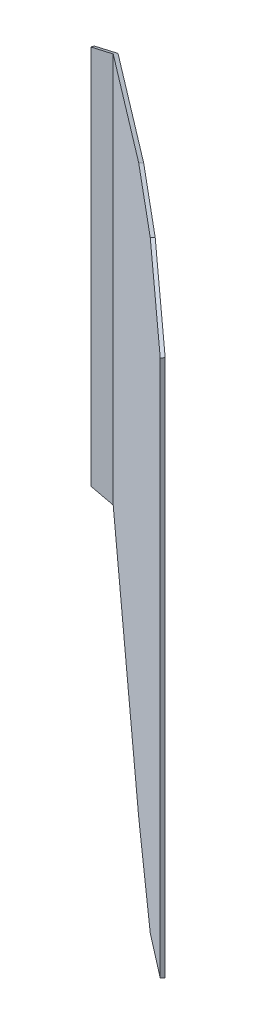
ISO-10303-21;
HEADER;
FILE_DESCRIPTION(('STEP AP214'),'2;1');
FILE_NAME('part.step','',(''),(''),'','','');
FILE_SCHEMA(('AUTOMOTIVE_DESIGN { 1 0 10303 214 1 1 1 1 }'));
ENDSEC;
DATA;
#1=APPLICATION_CONTEXT('core data for automotive mechanical design processes');
#2=APPLICATION_PROTOCOL_DEFINITION('international standard','automotive_design',2000,#1);
#3=PRODUCT_CONTEXT('',#1,'mechanical');
#4=PRODUCT('Part','Part','',(#3));
#5=PRODUCT_RELATED_PRODUCT_CATEGORY('part','',(#4));
#6=PRODUCT_DEFINITION_FORMATION('','',#4);
#7=PRODUCT_DEFINITION_CONTEXT('part definition',#1,'design');
#8=PRODUCT_DEFINITION('design','',#6,#7);
#9=PRODUCT_DEFINITION_SHAPE('','',#8);
#10=(LENGTH_UNIT() NAMED_UNIT(*) SI_UNIT(.MILLI.,.METRE.));
#11=(NAMED_UNIT(*) PLANE_ANGLE_UNIT() SI_UNIT($,.RADIAN.));
#12=(NAMED_UNIT(*) SI_UNIT($,.STERADIAN.) SOLID_ANGLE_UNIT());
#13=UNCERTAINTY_MEASURE_WITH_UNIT(LENGTH_MEASURE(1.E-05),#10,'distance_accuracy_value','');
#14=(GEOMETRIC_REPRESENTATION_CONTEXT(3) GLOBAL_UNCERTAINTY_ASSIGNED_CONTEXT((#13)) GLOBAL_UNIT_ASSIGNED_CONTEXT((#10,
#11,#12)) REPRESENTATION_CONTEXT('',''));
#15=CARTESIAN_POINT('',(0.,0.,0.));
#16=DIRECTION('',(0.,0.,1.));
#17=DIRECTION('',(1.,0.,0.));
#18=AXIS2_PLACEMENT_3D('',#15,#16,#17);
#19=CARTESIAN_POINT('',(958.263871938385,-400.,462.03543703626));
#20=DIRECTION('',(0.656059028990508,0.,-0.754709580222771));
#21=DIRECTION('',(-0.754709580222771,0.,-0.656059028990508));
#22=AXIS2_PLACEMENT_3D('',#19,#20,#21);
#23=PLANE('',#22);
#24=DIRECTION('',(-0.714377011708552,-0.322531231414625,-0.620998462079033));
#25=VECTOR('',#24,1.);
#26=CARTESIAN_POINT('',(771.730349835547,325.358760794224,299.884320114112));
#27=LINE('',#26,#25);
#28=CARTESIAN_POINT('',(769.864547225332,324.516377005852,298.262402649669));
#29=VERTEX_POINT('',#28);
#30=CARTESIAN_POINT('',(545.,222.993178289504,102.790633941637));
#31=VERTEX_POINT('',#30);
#32=EDGE_CURVE('E133',#29,#31,#27,.T.);
#33=ORIENTED_EDGE('',*,*,#32,.F.);
#34=DIRECTION('',(0.74602943431762,0.151229402481054,0.648513493272851));
#35=VECTOR('',#34,1.);
#36=CARTESIAN_POINT('',(872.214030364498,345.263884365985,387.233450964892));
#37=LINE('',#36,#35);
#38=CARTESIAN_POINT('',(870.728695458336,344.962788591462,385.942269029749));
#39=VERTEX_POINT('',#38);
#40=EDGE_CURVE('E124',#29,#39,#37,.T.);
#41=ORIENTED_EDGE('',*,*,#40,.T.);
#42=DIRECTION('',(0.718149384400474,-0.307471576705268,0.624277735630221));
#43=VECTOR('',#42,1.);
#44=CARTESIAN_POINT('',(1114.48402734046,240.60032884128,597.835546306873));
#45=LINE('',#44,#43);
#46=CARTESIAN_POINT('',(958.263871938385,307.485100363735,462.03543703626));
#47=VERTEX_POINT('',#46);
#48=EDGE_CURVE('E130',#39,#47,#45,.T.);
#49=ORIENTED_EDGE('',*,*,#48,.T.);
#50=DIRECTION('',(0.,1.,0.));
#51=VECTOR('',#50,1.);
#52=CARTESIAN_POINT('',(958.263871938385,-400.,462.03543703626));
#53=LINE('',#52,#51);
#54=CARTESIAN_POINT('',(958.263871938385,-307.485100363735,462.03543703626));
#55=VERTEX_POINT('',#54);
#56=EDGE_CURVE('E185',#55,#47,#53,.T.);
#57=ORIENTED_EDGE('',*,*,#56,.F.);
#58=DIRECTION('',(-0.718149384400474,-0.307471576705268,-0.624277735630221));
#59=VECTOR('',#58,1.);
#60=CARTESIAN_POINT('',(937.835608515234,-316.231345226578,444.277418565898));
#61=LINE('',#60,#59);
#62=CARTESIAN_POINT('',(870.728695458336,-344.962788591462,385.942269029749));
#63=VERTEX_POINT('',#62);
#64=EDGE_CURVE('E154',#55,#63,#61,.T.);
#65=ORIENTED_EDGE('',*,*,#64,.T.);
#66=DIRECTION('',(-0.74602943431762,0.151229402481054,-0.648513493272851));
#67=VECTOR('',#66,1.);
#68=CARTESIAN_POINT('',(962.471298832604,-363.560150105806,465.692897435735));
#69=LINE('',#68,#67);
#70=CARTESIAN_POINT('',(769.864547225336,-324.516377005853,298.262402649672));
#71=VERTEX_POINT('',#70);
#72=EDGE_CURVE('E145',#63,#71,#69,.T.);
#73=ORIENTED_EDGE('',*,*,#72,.T.);
#74=DIRECTION('',(-0.714377011708552,0.322531231414625,-0.620998462079033));
#75=VECTOR('',#74,1.);
#76=CARTESIAN_POINT('',(956.057467660075,-408.579876984491,460.117439058863));
#77=LINE('',#76,#75);
#78=CARTESIAN_POINT('',(545.,-222.993178289503,102.790633941637));
#79=VERTEX_POINT('',#78);
#80=EDGE_CURVE('E161',#71,#79,#77,.T.);
#81=ORIENTED_EDGE('',*,*,#80,.T.);
#82=DIRECTION('',(0.,1.,0.));
#83=VECTOR('',#82,1.);
#84=CARTESIAN_POINT('',(545.,-400.,102.790633941637));
#85=LINE('',#84,#83);
#86=EDGE_CURVE('E183',#79,#31,#85,.T.);
#87=ORIENTED_EDGE('',*,*,#86,.T.);
#88=EDGE_LOOP('',(#33,#41,#49,#57,#65,#73,#81,#87));
#89=FACE_BOUND('',#88,.T.);
#90=ADVANCED_FACE('F48',(#89),#23,.T.);
#91=CARTESIAN_POINT('',(955.639635822423,-400.,465.054275357151));
#92=DIRECTION('',(0.656059028990508,0.,-0.754709580222771));
#93=DIRECTION('',(-0.754709580222771,0.,-0.656059028990508));
#94=AXIS2_PLACEMENT_3D('',#91,#92,#93);
#95=PLANE('',#94);
#96=DIRECTION('',(0.74602943431762,0.151229402481054,0.648513493272851));
#97=VECTOR('',#96,1.);
#98=CARTESIAN_POINT('',(869.589794248536,345.263884365985,390.252289285783));
#99=LINE('',#98,#97);
#100=CARTESIAN_POINT('',(766.567607797982,324.380011716296,300.696468903486));
#101=VERTEX_POINT('',#100);
#102=CARTESIAN_POINT('',(868.104459342374,344.962788591462,388.96110735064));
#103=VERTEX_POINT('',#102);
#104=EDGE_CURVE('E63',#101,#103,#99,.T.);
#105=ORIENTED_EDGE('',*,*,#104,.F.);
#106=DIRECTION('',(-0.714377011708552,-0.322531231414625,-0.620998462079033));
#107=VECTOR('',#106,1.);
#108=CARTESIAN_POINT('',(769.067554595031,325.508702737574,302.869639499406));
#109=LINE('',#108,#107);
#110=CARTESIAN_POINT('',(543.504461282061,223.67012023066,106.790633941637));
#111=VERTEX_POINT('',#110);
#112=EDGE_CURVE('E170',#101,#111,#109,.T.);
#113=ORIENTED_EDGE('',*,*,#112,.T.);
#114=DIRECTION('',(0.,1.,0.));
#115=VECTOR('',#114,1.);
#116=CARTESIAN_POINT('',(543.504461282061,-400.,106.790633941637));
#117=LINE('',#116,#115);
#118=CARTESIAN_POINT('',(543.504461282061,-223.670120230659,106.790633941637));
#119=VERTEX_POINT('',#118);
#120=EDGE_CURVE('E190',#119,#111,#117,.T.);
#121=ORIENTED_EDGE('',*,*,#120,.F.);
#122=DIRECTION('',(-0.714377011708552,0.322531231414625,-0.620998462079033));
#123=VECTOR('',#122,1.);
#124=CARTESIAN_POINT('',(953.394672419559,-408.729818927841,463.102758444158));
#125=LINE('',#124,#123);
#126=CARTESIAN_POINT('',(766.567607797986,-324.380011716297,300.696468903489));
#127=VERTEX_POINT('',#126);
#128=EDGE_CURVE('E159',#127,#119,#125,.T.);
#129=ORIENTED_EDGE('',*,*,#128,.F.);
#130=DIRECTION('',(-0.74602943431762,0.151229402481054,-0.648513493272851));
#131=VECTOR('',#130,1.);
#132=CARTESIAN_POINT('',(959.847062716642,-363.560150105806,468.711735756626));
#133=LINE('',#132,#131);
#134=CARTESIAN_POINT('',(868.104459342374,-344.962788591462,388.96110735064));
#135=VERTEX_POINT('',#134);
#136=EDGE_CURVE('E139',#135,#127,#133,.T.);
#137=ORIENTED_EDGE('',*,*,#136,.F.);
#138=DIRECTION('',(-0.718149384400474,-0.307471576705268,-0.624277735630221));
#139=VECTOR('',#138,1.);
#140=CARTESIAN_POINT('',(935.211372399272,-316.231345226578,447.296256886789));
#141=LINE('',#140,#139);
#142=CARTESIAN_POINT('',(955.639635822423,-307.485100363735,465.054275357151));
#143=VERTEX_POINT('',#142);
#144=EDGE_CURVE('E151',#143,#135,#141,.T.);
#145=ORIENTED_EDGE('',*,*,#144,.F.);
#146=DIRECTION('',(0.,1.,0.));
#147=VECTOR('',#146,1.);
#148=CARTESIAN_POINT('',(955.639635822423,-400.,465.054275357151));
#149=LINE('',#148,#147);
#150=CARTESIAN_POINT('',(955.639635822423,307.485100363735,465.054275357151));
#151=VERTEX_POINT('',#150);
#152=EDGE_CURVE('E187',#143,#151,#149,.T.);
#153=ORIENTED_EDGE('',*,*,#152,.T.);
#154=DIRECTION('',(0.718149384400474,-0.307471576705268,0.624277735630221));
#155=VECTOR('',#154,1.);
#156=CARTESIAN_POINT('',(1111.8597912245,240.60032884128,600.854384627764));
#157=LINE('',#156,#155);
#158=EDGE_CURVE('E69',#103,#151,#157,.T.);
#159=ORIENTED_EDGE('',*,*,#158,.F.);
#160=EDGE_LOOP('',(#105,#113,#121,#129,#137,#145,#153,#159));
#161=FACE_BOUND('',#160,.T.);
#162=ADVANCED_FACE('F207',(#161),#95,.F.);
#163=CARTESIAN_POINT('',(-14.7084032822513,64.0296572140644,-16.3353367584323));
#164=DIRECTION('',(0.217265952213146,-0.945817447178789,0.241298285574338));
#165=DIRECTION('',(0.,-0.247203369569301,-0.968963618550038));
#166=AXIS2_PLACEMENT_3D('',#163,#164,#165);
#167=PLANE('',#166);
#168=DIRECTION('',(-0.804057823289808,-0.0332567765677724,0.593620252028834));
#169=VECTOR('',#168,1.);
#170=CARTESIAN_POINT('',(405.824651558385,309.459259070707,567.025977053042));
#171=LINE('',#170,#169);
#172=EDGE_CURVE('E134',#29,#101,#171,.T.);
#173=ORIENTED_EDGE('',*,*,#172,.F.);
#174=ORIENTED_EDGE('',*,*,#32,.T.);
#175=DIRECTION('',(-0.974616389908166,-0.223881425139231,0.));
#176=VECTOR('',#175,1.);
#177=CARTESIAN_POINT('',(409.063819039281,191.766958171927,102.790633941637));
#178=LINE('',#177,#176);
#179=CARTESIAN_POINT('',(517.881642577774,216.763756570364,102.790633941637));
#180=VERTEX_POINT('',#179);
#181=EDGE_CURVE('E173',#31,#180,#178,.T.);
#182=ORIENTED_EDGE('',*,*,#181,.T.);
#183=DIRECTION('',(0.,-0.247203369569301,-0.968963618550038));
#184=VECTOR('',#183,1.);
#185=CARTESIAN_POINT('',(517.881642577774,180.031752419011,-41.1878875530394));
#186=LINE('',#185,#184);
#187=CARTESIAN_POINT('',(517.881642577774,217.784242230865,106.790633941637));
#188=VERTEX_POINT('',#187);
#189=EDGE_CURVE('E176',#188,#180,#186,.T.);
#190=ORIENTED_EDGE('',*,*,#189,.F.);
#191=DIRECTION('',(-0.974616389908166,-0.223881425139231,0.));
#192=VECTOR('',#191,1.);
#193=CARTESIAN_POINT('',(408.841150592422,192.736294139346,106.790633941637));
#194=LINE('',#193,#192);
#195=EDGE_CURVE('E179',#111,#188,#194,.T.);
#196=ORIENTED_EDGE('',*,*,#195,.F.);
#197=ORIENTED_EDGE('',*,*,#112,.F.);
#198=EDGE_LOOP('',(#173,#174,#182,#190,#196,#197));
#199=FACE_BOUND('',#198,.T.);
#200=ADVANCED_FACE('F221',(#199),#167,.F.);
#201=CARTESIAN_POINT('',(141.124135037064,578.697205104585,122.677338973506));
#202=DIRECTION('',(0.232051744585666,0.95155726549608,0.201719504055439));
#203=DIRECTION('',(0.97152865701298,-0.236922072847922,0.));
#204=AXIS2_PLACEMENT_3D('',#201,#202,#203);
#205=PLANE('',#204);
#206=ORIENTED_EDGE('',*,*,#48,.F.);
#207=DIRECTION('',(-0.656059028990508,0.,0.754709580222771));
#208=VECTOR('',#207,1.);
#209=CARTESIAN_POINT('',(687.048506749006,344.962788591462,597.242155153355));
#210=LINE('',#209,#208);
#211=EDGE_CURVE('E13',#39,#103,#210,.T.);
#212=ORIENTED_EDGE('',*,*,#211,.T.);
#213=ORIENTED_EDGE('',*,*,#158,.T.);
#214=DIRECTION('',(0.656059028990517,0.,-0.754709580222763));
#215=VECTOR('',#214,1.);
#216=CARTESIAN_POINT('',(958.263871938387,307.485100363735,462.035437036257));
#217=LINE('',#216,#215);
#218=EDGE_CURVE('E137',#151,#47,#217,.T.);
#219=ORIENTED_EDGE('',*,*,#218,.T.);
#220=EDGE_LOOP('',(#206,#212,#213,#219));
#221=FACE_BOUND('',#220,.T.);
#222=ADVANCED_FACE('F136',(#221),#205,.T.);
#223=CARTESIAN_POINT('',(958.263871938385,-400.,462.03543703626));
#224=DIRECTION('',(-0.754709580222763,0.,-0.656059028990517));
#225=DIRECTION('',(-0.656059028990517,0.,0.754709580222763));
#226=AXIS2_PLACEMENT_3D('',#223,#224,#225);
#227=PLANE('',#226);
#228=ORIENTED_EDGE('',*,*,#218,.F.);
#229=ORIENTED_EDGE('',*,*,#152,.F.);
#230=DIRECTION('',(-0.656059028990517,0.,0.754709580222763));
#231=VECTOR('',#230,1.);
#232=CARTESIAN_POINT('',(958.263871938385,-307.485100363735,462.03543703626));
#233=LINE('',#232,#231);
#234=EDGE_CURVE('E157',#55,#143,#233,.T.);
#235=ORIENTED_EDGE('',*,*,#234,.F.);
#236=ORIENTED_EDGE('',*,*,#56,.T.);
#237=EDGE_LOOP('',(#228,#229,#235,#236));
#238=FACE_BOUND('',#237,.T.);
#239=ADVANCED_FACE('F204',(#238),#227,.F.);
#240=CARTESIAN_POINT('',(-14.7084032822511,-64.0296572140637,-16.3353367584321));
#241=DIRECTION('',(-0.217265952213146,-0.945817447178788,-0.241298285574338));
#242=DIRECTION('',(0.,0.247203369569301,-0.968963618550038));
#243=AXIS2_PLACEMENT_3D('',#240,#241,#242);
#244=PLANE('',#243);
#245=ORIENTED_EDGE('',*,*,#80,.F.);
#246=DIRECTION('',(-0.804057823289808,0.0332567765677724,0.593620252028835));
#247=VECTOR('',#246,1.);
#248=CARTESIAN_POINT('',(405.824651558387,-309.459259070708,567.025977053045));
#249=LINE('',#248,#247);
#250=EDGE_CURVE('E148',#71,#127,#249,.T.);
#251=ORIENTED_EDGE('',*,*,#250,.T.);
#252=ORIENTED_EDGE('',*,*,#128,.T.);
#253=DIRECTION('',(-0.974616389908166,0.223881425139231,0.));
#254=VECTOR('',#253,1.);
#255=CARTESIAN_POINT('',(583.399955661777,-232.834608157244,106.790633941637));
#256=LINE('',#255,#254);
#257=CARTESIAN_POINT('',(517.881642577774,-217.784242230864,106.790633941637));
#258=VERTEX_POINT('',#257);
#259=EDGE_CURVE('E168',#119,#258,#256,.T.);
#260=ORIENTED_EDGE('',*,*,#259,.T.);
#261=DIRECTION('',(0.,0.247203369569301,-0.968963618550038));
#262=VECTOR('',#261,1.);
#263=CARTESIAN_POINT('',(517.881642577774,-228.919357160144,150.436969643466));
#264=LINE('',#263,#262);
#265=CARTESIAN_POINT('',(517.881642577774,-216.763756570363,102.790633941637));
#266=VERTEX_POINT('',#265);
#267=EDGE_CURVE('E166',#258,#266,#264,.T.);
#268=ORIENTED_EDGE('',*,*,#267,.T.);
#269=DIRECTION('',(-0.974616389908166,0.223881425139231,0.));
#270=VECTOR('',#269,1.);
#271=CARTESIAN_POINT('',(583.622624108636,-231.865272189825,102.790633941637));
#272=LINE('',#271,#270);
#273=EDGE_CURVE('E163',#79,#266,#272,.T.);
#274=ORIENTED_EDGE('',*,*,#273,.F.);
#275=EDGE_LOOP('',(#245,#251,#252,#260,#268,#274));
#276=FACE_BOUND('',#275,.T.);
#277=ADVANCED_FACE('F212',(#276),#244,.T.);
#278=CARTESIAN_POINT('',(141.124135037064,-578.697205104585,122.677338973506));
#279=DIRECTION('',(0.232051744585666,-0.95155726549608,0.201719504055439));
#280=DIRECTION('',(0.97152865701298,0.236922072847922,0.));
#281=AXIS2_PLACEMENT_3D('',#278,#279,#280);
#282=PLANE('',#281);
#283=ORIENTED_EDGE('',*,*,#144,.T.);
#284=DIRECTION('',(0.656059028990508,0.,-0.754709580222771));
#285=VECTOR('',#284,1.);
#286=CARTESIAN_POINT('',(687.048506749006,-344.962788591462,597.242155153355));
#287=LINE('',#286,#285);
#288=EDGE_CURVE('E56',#135,#63,#287,.T.);
#289=ORIENTED_EDGE('',*,*,#288,.T.);
#290=ORIENTED_EDGE('',*,*,#64,.F.);
#291=ORIENTED_EDGE('',*,*,#234,.T.);
#292=EDGE_LOOP('',(#283,#289,#290,#291));
#293=FACE_BOUND('',#292,.T.);
#294=ADVANCED_FACE('F197',(#293),#282,.T.);
#295=CARTESIAN_POINT('',(545.,-400.,102.790633941637));
#296=DIRECTION('',(0.,0.,-1.));
#297=DIRECTION('',(-1.,0.,0.));
#298=AXIS2_PLACEMENT_3D('',#295,#296,#297);
#299=PLANE('',#298);
#300=ORIENTED_EDGE('',*,*,#86,.F.);
#301=ORIENTED_EDGE('',*,*,#273,.T.);
#302=DIRECTION('',(0.,1.,0.));
#303=VECTOR('',#302,1.);
#304=CARTESIAN_POINT('',(517.881642577774,-400.,102.790633941637));
#305=LINE('',#304,#303);
#306=EDGE_CURVE('E182',#266,#180,#305,.T.);
#307=ORIENTED_EDGE('',*,*,#306,.T.);
#308=ORIENTED_EDGE('',*,*,#181,.F.);
#309=EDGE_LOOP('',(#300,#301,#307,#308));
#310=FACE_BOUND('',#309,.T.);
#311=ADVANCED_FACE('F50',(#310),#299,.T.);
#312=CARTESIAN_POINT('',(545.,-400.,106.790633941637));
#313=DIRECTION('',(0.,0.,-1.));
#314=DIRECTION('',(-1.,0.,0.));
#315=AXIS2_PLACEMENT_3D('',#312,#313,#314);
#316=PLANE('',#315);
#317=ORIENTED_EDGE('',*,*,#259,.F.);
#318=ORIENTED_EDGE('',*,*,#120,.T.);
#319=ORIENTED_EDGE('',*,*,#195,.T.);
#320=DIRECTION('',(0.,1.,0.));
#321=VECTOR('',#320,1.);
#322=CARTESIAN_POINT('',(517.881642577774,-400.,106.790633941637));
#323=LINE('',#322,#321);
#324=EDGE_CURVE('E193',#258,#188,#323,.T.);
#325=ORIENTED_EDGE('',*,*,#324,.F.);
#326=EDGE_LOOP('',(#317,#318,#319,#325));
#327=FACE_BOUND('',#326,.T.);
#328=ADVANCED_FACE('F228',(#327),#316,.F.);
#329=CARTESIAN_POINT('',(517.881642577774,-400.,106.790633941637));
#330=DIRECTION('',(1.,0.,0.));
#331=DIRECTION('',(0.,0.,-1.));
#332=AXIS2_PLACEMENT_3D('',#329,#330,#331);
#333=PLANE('',#332);
#334=ORIENTED_EDGE('',*,*,#267,.F.);
#335=ORIENTED_EDGE('',*,*,#324,.T.);
#336=ORIENTED_EDGE('',*,*,#189,.T.);
#337=ORIENTED_EDGE('',*,*,#306,.F.);
#338=EDGE_LOOP('',(#334,#335,#336,#337));
#339=FACE_BOUND('',#338,.T.);
#340=ADVANCED_FACE('F225',(#339),#333,.F.);
#341=CARTESIAN_POINT('',(-23.2062212072235,-200.985361995135,-20.1728603302691));
#342=DIRECTION('',(-0.114134278863817,-0.988498693891511,-0.0992154149465349));
#343=DIRECTION('',(0.9934001516634,-0.114700212184349,0.));
#344=AXIS2_PLACEMENT_3D('',#341,#342,#343);
#345=PLANE('',#344);
#346=ORIENTED_EDGE('',*,*,#250,.F.);
#347=ORIENTED_EDGE('',*,*,#72,.F.);
#348=ORIENTED_EDGE('',*,*,#288,.F.);
#349=ORIENTED_EDGE('',*,*,#136,.T.);
#350=EDGE_LOOP('',(#346,#347,#348,#349));
#351=FACE_BOUND('',#350,.T.);
#352=ADVANCED_FACE('F210',(#351),#345,.T.);
#353=CARTESIAN_POINT('',(-23.2062212072235,200.985361995135,-20.1728603302691));
#354=DIRECTION('',(-0.114134278863817,0.988498693891511,-0.0992154149465349));
#355=DIRECTION('',(0.9934001516634,0.114700212184349,0.));
#356=AXIS2_PLACEMENT_3D('',#353,#354,#355);
#357=PLANE('',#356);
#358=ORIENTED_EDGE('',*,*,#40,.F.);
#359=ORIENTED_EDGE('',*,*,#172,.T.);
#360=ORIENTED_EDGE('',*,*,#104,.T.);
#361=ORIENTED_EDGE('',*,*,#211,.F.);
#362=EDGE_LOOP('',(#358,#359,#360,#361));
#363=FACE_BOUND('',#362,.T.);
#364=ADVANCED_FACE('F123',(#363),#357,.T.);
#365=CLOSED_SHELL('',(#90,#162,#200,#222,#239,#277,#294,#311,#328,#340,#352,#364));
#366=MANIFOLD_SOLID_BREP('B2',#365);
#367=ADVANCED_BREP_SHAPE_REPRESENTATION('',(#18,#366),#14);
#368=SHAPE_DEFINITION_REPRESENTATION(#9,#367);
ENDSEC;
END-ISO-10303-21;
